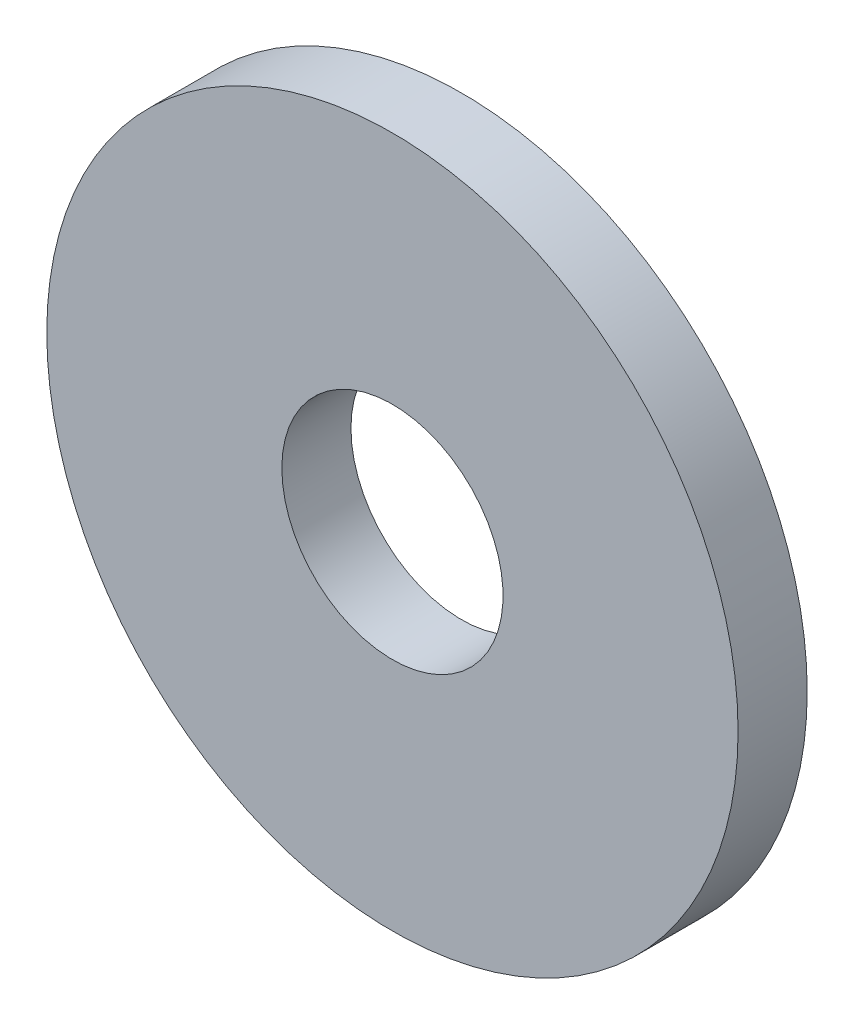
ISO-10303-21;
HEADER;
FILE_DESCRIPTION(('STEP AP214'),'2;1');
FILE_NAME('part.step','',(''),(''),'','','');
FILE_SCHEMA(('AUTOMOTIVE_DESIGN { 1 0 10303 214 1 1 1 1 }'));
ENDSEC;
DATA;
#1=APPLICATION_CONTEXT('core data for automotive mechanical design processes');
#2=APPLICATION_PROTOCOL_DEFINITION('international standard','automotive_design',2000,#1);
#3=PRODUCT_CONTEXT('',#1,'mechanical');
#4=PRODUCT('Part','Part','',(#3));
#5=PRODUCT_RELATED_PRODUCT_CATEGORY('part','',(#4));
#6=PRODUCT_DEFINITION_FORMATION('','',#4);
#7=PRODUCT_DEFINITION_CONTEXT('part definition',#1,'design');
#8=PRODUCT_DEFINITION('design','',#6,#7);
#9=PRODUCT_DEFINITION_SHAPE('','',#8);
#10=(LENGTH_UNIT() NAMED_UNIT(*) SI_UNIT(.MILLI.,.METRE.));
#11=(NAMED_UNIT(*) PLANE_ANGLE_UNIT() SI_UNIT($,.RADIAN.));
#12=(NAMED_UNIT(*) SI_UNIT($,.STERADIAN.) SOLID_ANGLE_UNIT());
#13=UNCERTAINTY_MEASURE_WITH_UNIT(LENGTH_MEASURE(1.E-05),#10,'distance_accuracy_value','');
#14=(GEOMETRIC_REPRESENTATION_CONTEXT(3) GLOBAL_UNCERTAINTY_ASSIGNED_CONTEXT((#13)) GLOBAL_UNIT_ASSIGNED_CONTEXT((#10,
#11,#12)) REPRESENTATION_CONTEXT('',''));
#15=CARTESIAN_POINT('',(0.,0.,0.));
#16=DIRECTION('',(0.,0.,1.));
#17=DIRECTION('',(1.,0.,0.));
#18=AXIS2_PLACEMENT_3D('',#15,#16,#17);
#19=CARTESIAN_POINT('',(0.,0.,1.));
#20=DIRECTION('',(0.,0.,-1.));
#21=DIRECTION('',(-1.,0.,0.));
#22=AXIS2_PLACEMENT_3D('',#19,#20,#21);
#23=CYLINDRICAL_SURFACE('',#22,1.6);
#24=CARTESIAN_POINT('',(0.,0.,0.));
#25=DIRECTION('',(0.,0.,-1.));
#26=DIRECTION('',(-1.,0.,0.));
#27=AXIS2_PLACEMENT_3D('',#24,#25,#26);
#28=CIRCLE('',#27,1.6);
#29=CARTESIAN_POINT('',(-1.6,0.,0.));
#30=VERTEX_POINT('',#29);
#31=EDGE_CURVE('E10',#30,#30,#28,.T.);
#32=ORIENTED_EDGE('',*,*,#31,.T.);
#33=EDGE_LOOP('',(#32));
#34=FACE_BOUND('',#33,.T.);
#35=CARTESIAN_POINT('',(0.,0.,1.));
#36=DIRECTION('',(0.,0.,-1.));
#37=DIRECTION('',(-1.,0.,0.));
#38=AXIS2_PLACEMENT_3D('',#35,#36,#37);
#39=CIRCLE('',#38,1.6);
#40=CARTESIAN_POINT('',(-1.6,0.,1.));
#41=VERTEX_POINT('',#40);
#42=EDGE_CURVE('E44',#41,#41,#39,.T.);
#43=ORIENTED_EDGE('',*,*,#42,.F.);
#44=EDGE_LOOP('',(#43));
#45=FACE_BOUND('',#44,.T.);
#46=ADVANCED_FACE('F30',(#34,#45),#23,.F.);
#47=CARTESIAN_POINT('',(1.6,0.,0.));
#48=DIRECTION('',(0.,0.,-1.));
#49=DIRECTION('',(-1.,0.,0.));
#50=AXIS2_PLACEMENT_3D('',#47,#48,#49);
#51=PLANE('',#50);
#52=CARTESIAN_POINT('',(0.,0.,0.));
#53=DIRECTION('',(0.,0.,-1.));
#54=DIRECTION('',(-1.,0.,0.));
#55=AXIS2_PLACEMENT_3D('',#52,#53,#54);
#56=CIRCLE('',#55,5.);
#57=CARTESIAN_POINT('',(-5.,0.,0.));
#58=VERTEX_POINT('',#57);
#59=EDGE_CURVE('E36',#58,#58,#56,.T.);
#60=ORIENTED_EDGE('',*,*,#59,.T.);
#61=EDGE_LOOP('',(#60));
#62=FACE_BOUND('',#61,.T.);
#63=ORIENTED_EDGE('',*,*,#31,.F.);
#64=EDGE_LOOP('',(#63));
#65=FACE_BOUND('',#64,.T.);
#66=ADVANCED_FACE('F54',(#62,#65),#51,.T.);
#67=CARTESIAN_POINT('',(0.,0.,1.));
#68=DIRECTION('',(0.,0.,-1.));
#69=DIRECTION('',(-1.,0.,0.));
#70=AXIS2_PLACEMENT_3D('',#67,#68,#69);
#71=CYLINDRICAL_SURFACE('',#70,5.);
#72=CARTESIAN_POINT('',(0.,0.,1.));
#73=DIRECTION('',(0.,0.,-1.));
#74=DIRECTION('',(-1.,0.,0.));
#75=AXIS2_PLACEMENT_3D('',#72,#73,#74);
#76=CIRCLE('',#75,5.);
#77=CARTESIAN_POINT('',(-5.,0.,1.));
#78=VERTEX_POINT('',#77);
#79=EDGE_CURVE('E40',#78,#78,#76,.T.);
#80=ORIENTED_EDGE('',*,*,#79,.T.);
#81=EDGE_LOOP('',(#80));
#82=FACE_BOUND('',#81,.T.);
#83=ORIENTED_EDGE('',*,*,#59,.F.);
#84=EDGE_LOOP('',(#83));
#85=FACE_BOUND('',#84,.T.);
#86=ADVANCED_FACE('F58',(#82,#85),#71,.T.);
#87=CARTESIAN_POINT('',(5.,0.,1.));
#88=DIRECTION('',(0.,0.,1.));
#89=DIRECTION('',(1.,0.,0.));
#90=AXIS2_PLACEMENT_3D('',#87,#88,#89);
#91=PLANE('',#90);
#92=ORIENTED_EDGE('',*,*,#42,.T.);
#93=EDGE_LOOP('',(#92));
#94=FACE_BOUND('',#93,.T.);
#95=ORIENTED_EDGE('',*,*,#79,.F.);
#96=EDGE_LOOP('',(#95));
#97=FACE_BOUND('',#96,.T.);
#98=ADVANCED_FACE('F50',(#94,#97),#91,.T.);
#99=CLOSED_SHELL('',(#46,#66,#86,#98));
#100=MANIFOLD_SOLID_BREP('B2',#99);
#101=ADVANCED_BREP_SHAPE_REPRESENTATION('',(#18,#100),#14);
#102=SHAPE_DEFINITION_REPRESENTATION(#9,#101);
ENDSEC;
END-ISO-10303-21;
